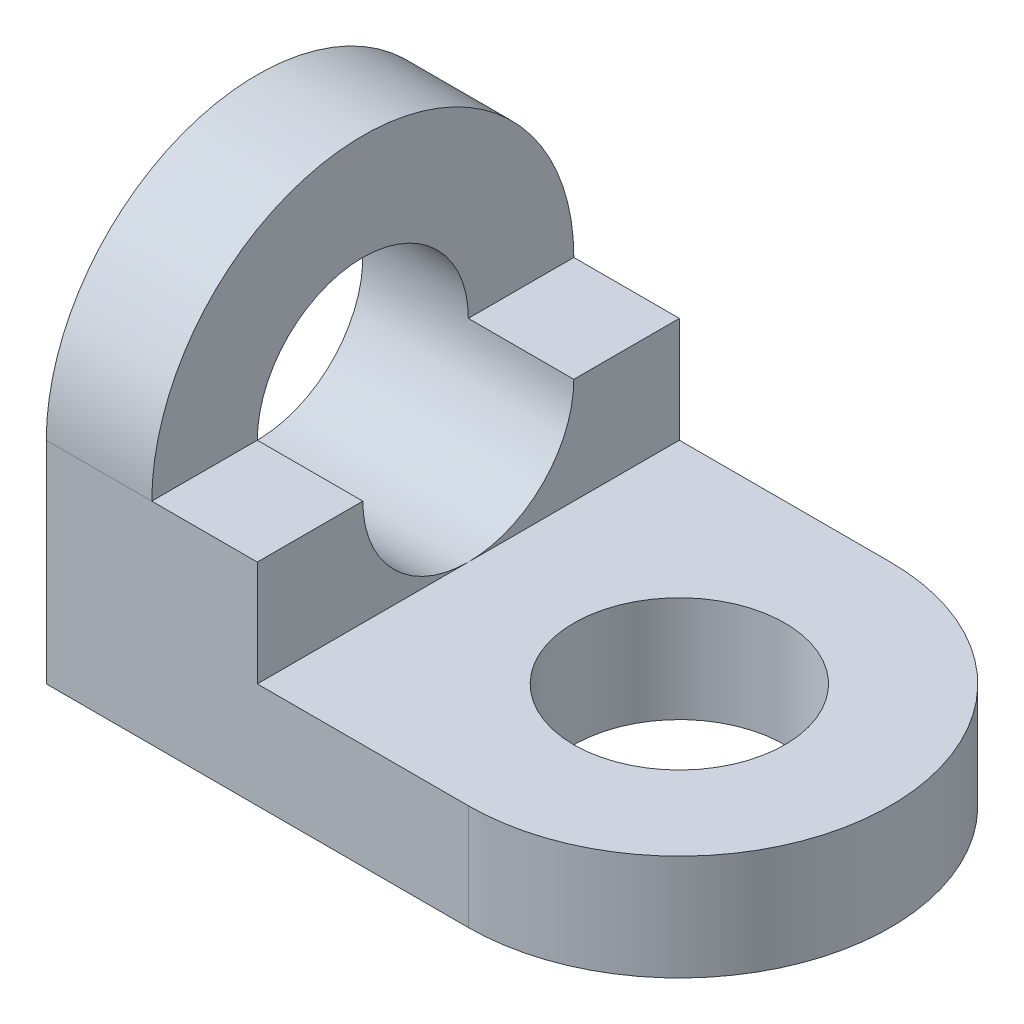
ISO-10303-21;
HEADER;
FILE_DESCRIPTION(('STEP AP214'),'2;1');
FILE_NAME('part.step','',(''),(''),'','','');
FILE_SCHEMA(('AUTOMOTIVE_DESIGN { 1 0 10303 214 1 1 1 1 }'));
ENDSEC;
DATA;
#1=APPLICATION_CONTEXT('core data for automotive mechanical design processes');
#2=APPLICATION_PROTOCOL_DEFINITION('international standard','automotive_design',2000,#1);
#3=PRODUCT_CONTEXT('',#1,'mechanical');
#4=PRODUCT('Part','Part','',(#3));
#5=PRODUCT_RELATED_PRODUCT_CATEGORY('part','',(#4));
#6=PRODUCT_DEFINITION_FORMATION('','',#4);
#7=PRODUCT_DEFINITION_CONTEXT('part definition',#1,'design');
#8=PRODUCT_DEFINITION('design','',#6,#7);
#9=PRODUCT_DEFINITION_SHAPE('','',#8);
#10=(LENGTH_UNIT() NAMED_UNIT(*) SI_UNIT(.MILLI.,.METRE.));
#11=(NAMED_UNIT(*) PLANE_ANGLE_UNIT() SI_UNIT($,.RADIAN.));
#12=(NAMED_UNIT(*) SI_UNIT($,.STERADIAN.) SOLID_ANGLE_UNIT());
#13=UNCERTAINTY_MEASURE_WITH_UNIT(LENGTH_MEASURE(1.E-05),#10,'distance_accuracy_value','');
#14=(GEOMETRIC_REPRESENTATION_CONTEXT(3) GLOBAL_UNCERTAINTY_ASSIGNED_CONTEXT((#13)) GLOBAL_UNIT_ASSIGNED_CONTEXT((#10,
#11,#12)) REPRESENTATION_CONTEXT('',''));
#15=CARTESIAN_POINT('',(0.,0.,0.));
#16=DIRECTION('',(0.,0.,1.));
#17=DIRECTION('',(1.,0.,0.));
#18=AXIS2_PLACEMENT_3D('',#15,#16,#17);
#19=CARTESIAN_POINT('',(254.,1016.,0.));
#20=DIRECTION('',(1.,0.,0.));
#21=DIRECTION('',(0.,0.,-1.));
#22=AXIS2_PLACEMENT_3D('',#19,#20,#21);
#23=PLANE('',#22);
#24=DIRECTION('',(0.,0.,1.));
#25=VECTOR('',#24,1.);
#26=CARTESIAN_POINT('',(254.,508.,0.));
#27=LINE('',#26,#25);
#28=CARTESIAN_POINT('',(254.,508.,-1016.));
#29=VERTEX_POINT('',#28);
#30=CARTESIAN_POINT('',(254.,508.,-762.));
#31=VERTEX_POINT('',#30);
#32=EDGE_CURVE('E149',#29,#31,#27,.T.);
#33=ORIENTED_EDGE('',*,*,#32,.F.);
#34=CARTESIAN_POINT('',(254.,508.,-508.));
#35=DIRECTION('',(-1.,0.,0.));
#36=DIRECTION('',(0.,0.,1.));
#37=AXIS2_PLACEMENT_3D('',#34,#35,#36);
#38=CIRCLE('',#37,508.);
#39=CARTESIAN_POINT('',(254.,508.,0.));
#40=VERTEX_POINT('',#39);
#41=EDGE_CURVE('E124',#40,#29,#38,.T.);
#42=ORIENTED_EDGE('',*,*,#41,.F.);
#43=CARTESIAN_POINT('',(254.,508.,-254.));
#44=VERTEX_POINT('',#43);
#45=EDGE_CURVE('E148',#44,#40,#27,.T.);
#46=ORIENTED_EDGE('',*,*,#45,.F.);
#47=CARTESIAN_POINT('',(254.,508.,-508.));
#48=DIRECTION('',(1.,0.,0.));
#49=DIRECTION('',(0.,0.,-1.));
#50=AXIS2_PLACEMENT_3D('',#47,#48,#49);
#51=CIRCLE('',#50,254.);
#52=EDGE_CURVE('E192',#31,#44,#51,.T.);
#53=ORIENTED_EDGE('',*,*,#52,.F.);
#54=EDGE_LOOP('',(#33,#42,#46,#53));
#55=FACE_BOUND('',#54,.T.);
#56=ADVANCED_FACE('F33',(#55),#23,.T.);
#57=CARTESIAN_POINT('',(0.,1016.,0.));
#58=DIRECTION('',(-1.,0.,0.));
#59=DIRECTION('',(0.,0.,1.));
#60=AXIS2_PLACEMENT_3D('',#57,#58,#59);
#61=PLANE('',#60);
#62=CARTESIAN_POINT('',(0.,508.,-508.));
#63=DIRECTION('',(-1.,0.,0.));
#64=DIRECTION('',(0.,0.,1.));
#65=AXIS2_PLACEMENT_3D('',#62,#63,#64);
#66=CIRCLE('',#65,254.);
#67=CARTESIAN_POINT('',(0.,508.,-254.));
#68=VERTEX_POINT('',#67);
#69=EDGE_CURVE('E194',#68,#68,#66,.T.);
#70=ORIENTED_EDGE('',*,*,#69,.F.);
#71=EDGE_LOOP('',(#70));
#72=FACE_BOUND('',#71,.T.);
#73=CARTESIAN_POINT('',(0.,508.,-508.));
#74=DIRECTION('',(-1.,0.,0.));
#75=DIRECTION('',(0.,0.,1.));
#76=AXIS2_PLACEMENT_3D('',#73,#74,#75);
#77=CIRCLE('',#76,508.);
#78=CARTESIAN_POINT('',(0.,508.,0.));
#79=VERTEX_POINT('',#78);
#80=CARTESIAN_POINT('',(0.,508.,-1016.));
#81=VERTEX_POINT('',#80);
#82=EDGE_CURVE('E115',#79,#81,#77,.T.);
#83=ORIENTED_EDGE('',*,*,#82,.T.);
#84=DIRECTION('',(0.,-1.,0.));
#85=VECTOR('',#84,1.);
#86=CARTESIAN_POINT('',(0.,1016.,-1016.));
#87=LINE('',#86,#85);
#88=CARTESIAN_POINT('',(0.,0.,-1016.));
#89=VERTEX_POINT('',#88);
#90=EDGE_CURVE('E120',#81,#89,#87,.T.);
#91=ORIENTED_EDGE('',*,*,#90,.T.);
#92=DIRECTION('',(0.,0.,-1.));
#93=VECTOR('',#92,1.);
#94=CARTESIAN_POINT('',(0.,0.,0.));
#95=LINE('',#94,#93);
#96=CARTESIAN_POINT('',(0.,0.,0.));
#97=VERTEX_POINT('',#96);
#98=EDGE_CURVE('E141',#97,#89,#95,.T.);
#99=ORIENTED_EDGE('',*,*,#98,.F.);
#100=DIRECTION('',(0.,-1.,0.));
#101=VECTOR('',#100,1.);
#102=CARTESIAN_POINT('',(0.,1016.,0.));
#103=LINE('',#102,#101);
#104=EDGE_CURVE('E121',#79,#97,#103,.T.);
#105=ORIENTED_EDGE('',*,*,#104,.F.);
#106=EDGE_LOOP('',(#83,#91,#99,#105));
#107=FACE_BOUND('',#106,.T.);
#108=ADVANCED_FACE('F117',(#72,#107),#61,.T.);
#109=CARTESIAN_POINT('',(0.,254.,0.));
#110=DIRECTION('',(0.,0.,1.));
#111=DIRECTION('',(1.,0.,0.));
#112=AXIS2_PLACEMENT_3D('',#109,#110,#111);
#113=PLANE('',#112);
#114=DIRECTION('',(-1.,0.,0.));
#115=VECTOR('',#114,1.);
#116=CARTESIAN_POINT('',(0.,508.,0.));
#117=LINE('',#116,#115);
#118=CARTESIAN_POINT('',(508.,508.,0.));
#119=VERTEX_POINT('',#118);
#120=EDGE_CURVE('E152',#119,#40,#117,.T.);
#121=ORIENTED_EDGE('',*,*,#120,.T.);
#122=DIRECTION('',(-1.,0.,0.));
#123=VECTOR('',#122,1.);
#124=CARTESIAN_POINT('',(254.,508.,0.));
#125=LINE('',#124,#123);
#126=EDGE_CURVE('E197',#40,#79,#125,.T.);
#127=ORIENTED_EDGE('',*,*,#126,.T.);
#128=ORIENTED_EDGE('',*,*,#104,.T.);
#129=DIRECTION('',(-1.,0.,0.));
#130=VECTOR('',#129,1.);
#131=CARTESIAN_POINT('',(0.,0.,0.));
#132=LINE('',#131,#130);
#133=CARTESIAN_POINT('',(1016.,0.,0.));
#134=VERTEX_POINT('',#133);
#135=EDGE_CURVE('E176',#134,#97,#132,.T.);
#136=ORIENTED_EDGE('',*,*,#135,.F.);
#137=DIRECTION('',(0.,-1.,0.));
#138=VECTOR('',#137,1.);
#139=CARTESIAN_POINT('',(1016.,254.,0.));
#140=LINE('',#139,#138);
#141=CARTESIAN_POINT('',(1016.,254.,0.));
#142=VERTEX_POINT('',#141);
#143=EDGE_CURVE('E11',#142,#134,#140,.T.);
#144=ORIENTED_EDGE('',*,*,#143,.F.);
#145=DIRECTION('',(-1.,0.,0.));
#146=VECTOR('',#145,1.);
#147=CARTESIAN_POINT('',(0.,254.,0.));
#148=LINE('',#147,#146);
#149=CARTESIAN_POINT('',(508.,254.,0.));
#150=VERTEX_POINT('',#149);
#151=EDGE_CURVE('E169',#142,#150,#148,.T.);
#152=ORIENTED_EDGE('',*,*,#151,.T.);
#153=DIRECTION('',(0.,-1.,0.));
#154=VECTOR('',#153,1.);
#155=CARTESIAN_POINT('',(508.,508.,0.));
#156=LINE('',#155,#154);
#157=EDGE_CURVE('E155',#119,#150,#156,.T.);
#158=ORIENTED_EDGE('',*,*,#157,.F.);
#159=EDGE_LOOP('',(#121,#127,#128,#136,#144,#152,#158));
#160=FACE_BOUND('',#159,.T.);
#161=ADVANCED_FACE('F200',(#160),#113,.T.);
#162=CARTESIAN_POINT('',(508.,508.,0.));
#163=DIRECTION('',(1.,0.,0.));
#164=DIRECTION('',(0.,0.,-1.));
#165=AXIS2_PLACEMENT_3D('',#162,#163,#164);
#166=PLANE('',#165);
#167=CARTESIAN_POINT('',(508.,508.,-508.));
#168=DIRECTION('',(1.,0.,0.));
#169=DIRECTION('',(0.,0.,-1.));
#170=AXIS2_PLACEMENT_3D('',#167,#168,#169);
#171=CIRCLE('',#170,254.);
#172=CARTESIAN_POINT('',(508.,508.,-254.));
#173=VERTEX_POINT('',#172);
#174=CARTESIAN_POINT('',(508.,254.,-508.));
#175=VERTEX_POINT('',#174);
#176=EDGE_CURVE('E185',#173,#175,#171,.T.);
#177=ORIENTED_EDGE('',*,*,#176,.F.);
#178=DIRECTION('',(0.,0.,1.));
#179=VECTOR('',#178,1.);
#180=CARTESIAN_POINT('',(508.,508.,0.));
#181=LINE('',#180,#179);
#182=EDGE_CURVE('E137',#173,#119,#181,.T.);
#183=ORIENTED_EDGE('',*,*,#182,.T.);
#184=ORIENTED_EDGE('',*,*,#157,.T.);
#185=DIRECTION('',(0.,0.,1.));
#186=VECTOR('',#185,1.);
#187=CARTESIAN_POINT('',(508.,254.,0.));
#188=LINE('',#187,#186);
#189=EDGE_CURVE('E75',#175,#150,#188,.T.);
#190=ORIENTED_EDGE('',*,*,#189,.F.);
#191=EDGE_LOOP('',(#177,#183,#184,#190));
#192=FACE_BOUND('',#191,.T.);
#193=ADVANCED_FACE('F216',(#192),#166,.T.);
#194=CARTESIAN_POINT('',(0.,508.,0.));
#195=DIRECTION('',(0.,1.,0.));
#196=DIRECTION('',(0.,0.,1.));
#197=AXIS2_PLACEMENT_3D('',#194,#195,#196);
#198=PLANE('',#197);
#199=DIRECTION('',(-1.,0.,0.));
#200=VECTOR('',#199,1.);
#201=CARTESIAN_POINT('',(1524.,508.,-762.));
#202=LINE('',#201,#200);
#203=CARTESIAN_POINT('',(508.,508.,-762.));
#204=VERTEX_POINT('',#203);
#205=EDGE_CURVE('E48',#204,#31,#202,.T.);
#206=ORIENTED_EDGE('',*,*,#205,.F.);
#207=CARTESIAN_POINT('',(508.,508.,-1016.));
#208=VERTEX_POINT('',#207);
#209=EDGE_CURVE('E139',#208,#204,#181,.T.);
#210=ORIENTED_EDGE('',*,*,#209,.F.);
#211=DIRECTION('',(1.,0.,0.));
#212=VECTOR('',#211,1.);
#213=CARTESIAN_POINT('',(0.,508.,-1016.));
#214=LINE('',#213,#212);
#215=EDGE_CURVE('E146',#29,#208,#214,.T.);
#216=ORIENTED_EDGE('',*,*,#215,.F.);
#217=ORIENTED_EDGE('',*,*,#32,.T.);
#218=EDGE_LOOP('',(#206,#210,#216,#217));
#219=FACE_BOUND('',#218,.T.);
#220=ADVANCED_FACE('F222',(#219),#198,.T.);
#221=CARTESIAN_POINT('',(0.,254.,-1016.));
#222=DIRECTION('',(0.,0.,-1.));
#223=DIRECTION('',(-1.,0.,0.));
#224=AXIS2_PLACEMENT_3D('',#221,#222,#223);
#225=PLANE('',#224);
#226=DIRECTION('',(-1.,0.,0.));
#227=VECTOR('',#226,1.);
#228=CARTESIAN_POINT('',(254.,508.,-1016.));
#229=LINE('',#228,#227);
#230=EDGE_CURVE('E125',#29,#81,#229,.T.);
#231=ORIENTED_EDGE('',*,*,#230,.F.);
#232=ORIENTED_EDGE('',*,*,#215,.T.);
#233=DIRECTION('',(0.,-1.,0.));
#234=VECTOR('',#233,1.);
#235=CARTESIAN_POINT('',(508.,508.,-1016.));
#236=LINE('',#235,#234);
#237=CARTESIAN_POINT('',(508.,254.,-1016.));
#238=VERTEX_POINT('',#237);
#239=EDGE_CURVE('E157',#208,#238,#236,.T.);
#240=ORIENTED_EDGE('',*,*,#239,.T.);
#241=DIRECTION('',(1.,0.,0.));
#242=VECTOR('',#241,1.);
#243=CARTESIAN_POINT('',(0.,254.,-1016.));
#244=LINE('',#243,#242);
#245=CARTESIAN_POINT('',(1016.,254.,-1016.));
#246=VERTEX_POINT('',#245);
#247=EDGE_CURVE('E164',#238,#246,#244,.T.);
#248=ORIENTED_EDGE('',*,*,#247,.T.);
#249=DIRECTION('',(0.,-1.,0.));
#250=VECTOR('',#249,1.);
#251=CARTESIAN_POINT('',(1016.,254.,-1016.));
#252=LINE('',#251,#250);
#253=CARTESIAN_POINT('',(1016.,0.,-1016.));
#254=VERTEX_POINT('',#253);
#255=EDGE_CURVE('E41',#246,#254,#252,.T.);
#256=ORIENTED_EDGE('',*,*,#255,.T.);
#257=DIRECTION('',(1.,0.,0.));
#258=VECTOR('',#257,1.);
#259=CARTESIAN_POINT('',(0.,0.,-1016.));
#260=LINE('',#259,#258);
#261=EDGE_CURVE('E135',#89,#254,#260,.T.);
#262=ORIENTED_EDGE('',*,*,#261,.F.);
#263=ORIENTED_EDGE('',*,*,#90,.F.);
#264=EDGE_LOOP('',(#231,#232,#240,#248,#256,#262,#263));
#265=FACE_BOUND('',#264,.T.);
#266=ADVANCED_FACE('F133',(#265),#225,.T.);
#267=CARTESIAN_POINT('',(1016.,254.,-508.));
#268=DIRECTION('',(0.,-1.,0.));
#269=DIRECTION('',(0.,0.,-1.));
#270=AXIS2_PLACEMENT_3D('',#267,#268,#269);
#271=CYLINDRICAL_SURFACE('',#270,254.);
#272=CARTESIAN_POINT('',(1016.,254.,-508.));
#273=DIRECTION('',(0.,1.,0.));
#274=DIRECTION('',(0.,0.,1.));
#275=AXIS2_PLACEMENT_3D('',#272,#273,#274);
#276=CIRCLE('',#275,254.);
#277=CARTESIAN_POINT('',(1016.,254.,-254.));
#278=VERTEX_POINT('',#277);
#279=EDGE_CURVE('E161',#278,#278,#276,.T.);
#280=ORIENTED_EDGE('',*,*,#279,.T.);
#281=EDGE_LOOP('',(#280));
#282=FACE_BOUND('',#281,.T.);
#283=CARTESIAN_POINT('',(1016.,0.,-508.));
#284=DIRECTION('',(0.,1.,0.));
#285=DIRECTION('',(0.,0.,1.));
#286=AXIS2_PLACEMENT_3D('',#283,#284,#285);
#287=CIRCLE('',#286,254.);
#288=CARTESIAN_POINT('',(1016.,0.,-254.));
#289=VERTEX_POINT('',#288);
#290=EDGE_CURVE('E160',#289,#289,#287,.T.);
#291=ORIENTED_EDGE('',*,*,#290,.F.);
#292=EDGE_LOOP('',(#291));
#293=FACE_BOUND('',#292,.T.);
#294=ADVANCED_FACE('F35',(#282,#293),#271,.F.);
#295=CARTESIAN_POINT('',(1016.,254.,-508.));
#296=DIRECTION('',(0.,-1.,0.));
#297=DIRECTION('',(0.,0.,-1.));
#298=AXIS2_PLACEMENT_3D('',#295,#296,#297);
#299=CYLINDRICAL_SURFACE('',#298,508.);
#300=CARTESIAN_POINT('',(1016.,0.,-508.));
#301=DIRECTION('',(0.,1.,0.));
#302=DIRECTION('',(0.,0.,1.));
#303=AXIS2_PLACEMENT_3D('',#300,#301,#302);
#304=CIRCLE('',#303,508.);
#305=EDGE_CURVE('E165',#134,#254,#304,.T.);
#306=ORIENTED_EDGE('',*,*,#305,.T.);
#307=ORIENTED_EDGE('',*,*,#255,.F.);
#308=CARTESIAN_POINT('',(1016.,254.,-508.));
#309=DIRECTION('',(0.,1.,0.));
#310=DIRECTION('',(0.,0.,1.));
#311=AXIS2_PLACEMENT_3D('',#308,#309,#310);
#312=CIRCLE('',#311,508.);
#313=EDGE_CURVE('E57',#142,#246,#312,.T.);
#314=ORIENTED_EDGE('',*,*,#313,.F.);
#315=ORIENTED_EDGE('',*,*,#143,.T.);
#316=EDGE_LOOP('',(#306,#307,#314,#315));
#317=FACE_BOUND('',#316,.T.);
#318=ADVANCED_FACE('F181',(#317),#299,.T.);
#319=CARTESIAN_POINT('',(0.,254.,0.));
#320=DIRECTION('',(0.,1.,0.));
#321=DIRECTION('',(0.,0.,1.));
#322=AXIS2_PLACEMENT_3D('',#319,#320,#321);
#323=PLANE('',#322);
#324=ORIENTED_EDGE('',*,*,#279,.F.);
#325=EDGE_LOOP('',(#324));
#326=FACE_BOUND('',#325,.T.);
#327=ORIENTED_EDGE('',*,*,#313,.T.);
#328=ORIENTED_EDGE('',*,*,#247,.F.);
#329=EDGE_CURVE('E167',#238,#175,#188,.T.);
#330=ORIENTED_EDGE('',*,*,#329,.T.);
#331=ORIENTED_EDGE('',*,*,#189,.T.);
#332=ORIENTED_EDGE('',*,*,#151,.F.);
#333=EDGE_LOOP('',(#327,#328,#330,#331,#332));
#334=FACE_BOUND('',#333,.T.);
#335=ADVANCED_FACE('F217',(#326,#334),#323,.T.);
#336=CARTESIAN_POINT('',(0.,0.,0.));
#337=DIRECTION('',(0.,1.,0.));
#338=DIRECTION('',(0.,0.,1.));
#339=AXIS2_PLACEMENT_3D('',#336,#337,#338);
#340=PLANE('',#339);
#341=ORIENTED_EDGE('',*,*,#290,.T.);
#342=EDGE_LOOP('',(#341));
#343=FACE_BOUND('',#342,.T.);
#344=ORIENTED_EDGE('',*,*,#261,.T.);
#345=ORIENTED_EDGE('',*,*,#305,.F.);
#346=ORIENTED_EDGE('',*,*,#135,.T.);
#347=ORIENTED_EDGE('',*,*,#98,.T.);
#348=EDGE_LOOP('',(#344,#345,#346,#347));
#349=FACE_BOUND('',#348,.T.);
#350=ADVANCED_FACE('F184',(#343,#349),#340,.F.);
#351=EDGE_CURVE('E186',#175,#204,#171,.T.);
#352=ORIENTED_EDGE('',*,*,#351,.F.);
#353=ORIENTED_EDGE('',*,*,#329,.F.);
#354=ORIENTED_EDGE('',*,*,#239,.F.);
#355=ORIENTED_EDGE('',*,*,#209,.T.);
#356=EDGE_LOOP('',(#352,#353,#354,#355));
#357=FACE_BOUND('',#356,.T.);
#358=ADVANCED_FACE('F219',(#357),#166,.T.);
#359=DIRECTION('',(-1.,0.,0.));
#360=VECTOR('',#359,1.);
#361=CARTESIAN_POINT('',(1524.,508.,-254.));
#362=LINE('',#361,#360);
#363=EDGE_CURVE('E190',#44,#173,#362,.F.);
#364=ORIENTED_EDGE('',*,*,#363,.F.);
#365=ORIENTED_EDGE('',*,*,#45,.T.);
#366=ORIENTED_EDGE('',*,*,#120,.F.);
#367=ORIENTED_EDGE('',*,*,#182,.F.);
#368=EDGE_LOOP('',(#364,#365,#366,#367));
#369=FACE_BOUND('',#368,.T.);
#370=ADVANCED_FACE('F209',(#369),#198,.T.);
#371=CARTESIAN_POINT('',(1524.,508.,-508.));
#372=DIRECTION('',(-1.,0.,0.));
#373=DIRECTION('',(0.,0.,1.));
#374=AXIS2_PLACEMENT_3D('',#371,#372,#373);
#375=CYLINDRICAL_SURFACE('',#374,254.);
#376=ORIENTED_EDGE('',*,*,#176,.T.);
#377=ORIENTED_EDGE('',*,*,#351,.T.);
#378=ORIENTED_EDGE('',*,*,#205,.T.);
#379=ORIENTED_EDGE('',*,*,#52,.T.);
#380=ORIENTED_EDGE('',*,*,#363,.T.);
#381=EDGE_LOOP('',(#376,#377,#378,#379,#380));
#382=FACE_BOUND('',#381,.T.);
#383=ORIENTED_EDGE('',*,*,#69,.T.);
#384=EDGE_LOOP('',(#383));
#385=FACE_BOUND('',#384,.T.);
#386=ADVANCED_FACE('F212',(#382,#385),#375,.F.);
#387=CARTESIAN_POINT('',(254.,508.,-508.));
#388=DIRECTION('',(-1.,0.,0.));
#389=DIRECTION('',(0.,0.,1.));
#390=AXIS2_PLACEMENT_3D('',#387,#388,#389);
#391=CYLINDRICAL_SURFACE('',#390,508.);
#392=ORIENTED_EDGE('',*,*,#82,.F.);
#393=ORIENTED_EDGE('',*,*,#126,.F.);
#394=ORIENTED_EDGE('',*,*,#41,.T.);
#395=ORIENTED_EDGE('',*,*,#230,.T.);
#396=EDGE_LOOP('',(#392,#393,#394,#395));
#397=FACE_BOUND('',#396,.T.);
#398=ADVANCED_FACE('F128',(#397),#391,.T.);
#399=CLOSED_SHELL('',(#56,#108,#161,#193,#220,#266,#294,#318,#335,#350,#358,#370,#386,#398));
#400=MANIFOLD_SOLID_BREP('B2',#399);
#401=ADVANCED_BREP_SHAPE_REPRESENTATION('',(#18,#400),#14);
#402=SHAPE_DEFINITION_REPRESENTATION(#9,#401);
ENDSEC;
END-ISO-10303-21;
